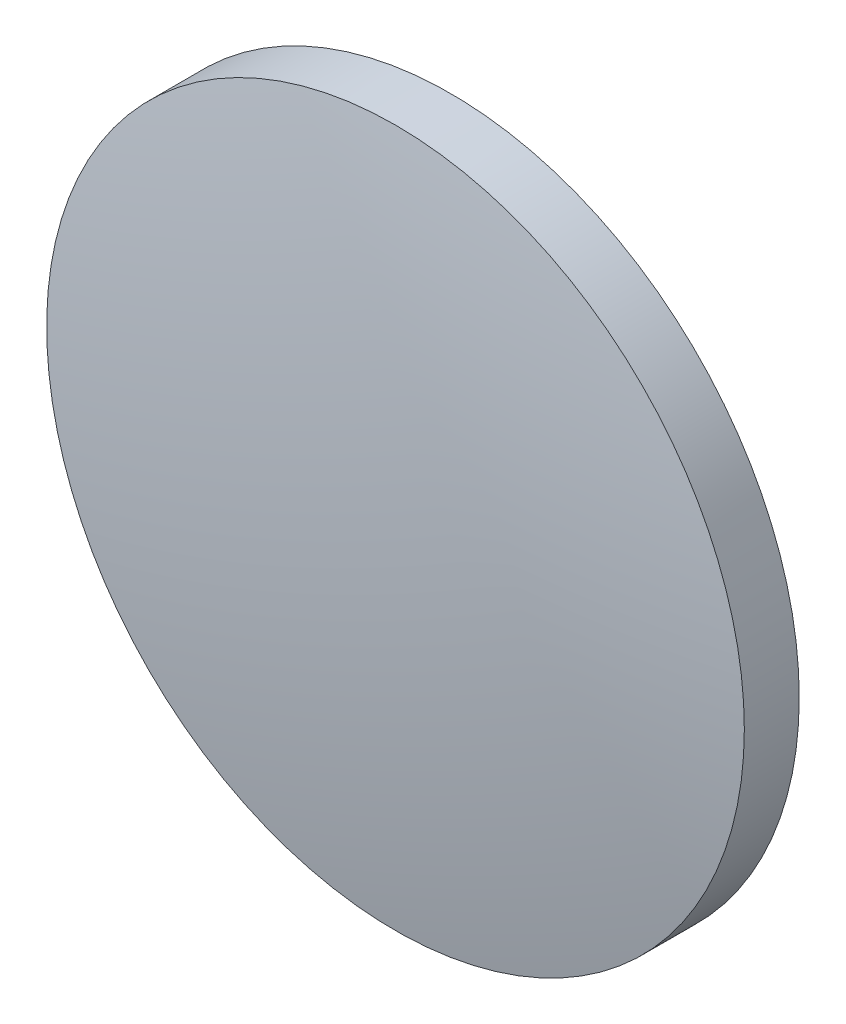
ISO-10303-21;
HEADER;
FILE_DESCRIPTION(('STEP AP214'),'2;1');
FILE_NAME('part.step','',(''),(''),'','','');
FILE_SCHEMA(('AUTOMOTIVE_DESIGN { 1 0 10303 214 1 1 1 1 }'));
ENDSEC;
DATA;
#1=APPLICATION_CONTEXT('core data for automotive mechanical design processes');
#2=APPLICATION_PROTOCOL_DEFINITION('international standard','automotive_design',2000,#1);
#3=PRODUCT_CONTEXT('',#1,'mechanical');
#4=PRODUCT('Part','Part','',(#3));
#5=PRODUCT_RELATED_PRODUCT_CATEGORY('part','',(#4));
#6=PRODUCT_DEFINITION_FORMATION('','',#4);
#7=PRODUCT_DEFINITION_CONTEXT('part definition',#1,'design');
#8=PRODUCT_DEFINITION('design','',#6,#7);
#9=PRODUCT_DEFINITION_SHAPE('','',#8);
#10=(LENGTH_UNIT() NAMED_UNIT(*) SI_UNIT(.MILLI.,.METRE.));
#11=(NAMED_UNIT(*) PLANE_ANGLE_UNIT() SI_UNIT($,.RADIAN.));
#12=(NAMED_UNIT(*) SI_UNIT($,.STERADIAN.) SOLID_ANGLE_UNIT());
#13=UNCERTAINTY_MEASURE_WITH_UNIT(LENGTH_MEASURE(1.E-05),#10,'distance_accuracy_value','');
#14=(GEOMETRIC_REPRESENTATION_CONTEXT(3) GLOBAL_UNCERTAINTY_ASSIGNED_CONTEXT((#13)) GLOBAL_UNIT_ASSIGNED_CONTEXT((#10,
#11,#12)) REPRESENTATION_CONTEXT('',''));
#15=CARTESIAN_POINT('',(0.,0.,0.));
#16=DIRECTION('',(0.,0.,1.));
#17=DIRECTION('',(1.,0.,0.));
#18=AXIS2_PLACEMENT_3D('',#15,#16,#17);
#19=CARTESIAN_POINT('',(0.,0.,-75.735));
#20=DIRECTION('',(0.,0.,1.));
#21=DIRECTION('',(0.,1.,0.));
#22=AXIS2_PLACEMENT_3D('',#19,#20,#21);
#23=SPHERICAL_SURFACE('',#22,77.26);
#24=CARTESIAN_POINT('',(0.,0.,0.474038833986084));
#25=DIRECTION('',(0.,0.,1.));
#26=DIRECTION('',(1.,0.,0.));
#27=AXIS2_PLACEMENT_3D('',#24,#25,#26);
#28=CIRCLE('',#27,12.7);
#29=CARTESIAN_POINT('',(12.7,0.,0.474038833986084));
#30=VERTEX_POINT('',#29);
#31=EDGE_CURVE('E8',#30,#30,#28,.T.);
#32=ORIENTED_EDGE('',*,*,#31,.T.);
#33=EDGE_LOOP('',(#32));
#34=FACE_BOUND('',#33,.T.);
#35=ADVANCED_FACE('F12',(#34),#23,.T.);
#36=CARTESIAN_POINT('',(0.,0.,4.30813204540037));
#37=DIRECTION('',(0.,0.,1.));
#38=DIRECTION('',(1.,0.,0.));
#39=AXIS2_PLACEMENT_3D('',#36,#37,#38);
#40=CYLINDRICAL_SURFACE('',#39,12.7);
#41=ORIENTED_EDGE('',*,*,#31,.F.);
#42=EDGE_LOOP('',(#41));
#43=FACE_BOUND('',#42,.T.);
#44=CARTESIAN_POINT('',(0.,0.,-1.525));
#45=DIRECTION('',(0.,0.,1.));
#46=DIRECTION('',(1.,0.,0.));
#47=AXIS2_PLACEMENT_3D('',#44,#45,#46);
#48=CIRCLE('',#47,12.7);
#49=CARTESIAN_POINT('',(12.7,0.,-1.525));
#50=VERTEX_POINT('',#49);
#51=EDGE_CURVE('E18',#50,#50,#48,.T.);
#52=ORIENTED_EDGE('',*,*,#51,.T.);
#53=EDGE_LOOP('',(#52));
#54=FACE_BOUND('',#53,.T.);
#55=ADVANCED_FACE('F24',(#43,#54),#40,.T.);
#56=CARTESIAN_POINT('',(0.,0.,-1.525));
#57=DIRECTION('',(0.,0.,1.));
#58=DIRECTION('',(1.,0.,0.));
#59=AXIS2_PLACEMENT_3D('',#56,#57,#58);
#60=PLANE('',#59);
#61=ORIENTED_EDGE('',*,*,#51,.F.);
#62=EDGE_LOOP('',(#61));
#63=FACE_BOUND('',#62,.T.);
#64=ADVANCED_FACE('F26',(#63),#60,.F.);
#65=CLOSED_SHELL('',(#35,#55,#64));
#66=MANIFOLD_SOLID_BREP('B1',#65);
#67=ADVANCED_BREP_SHAPE_REPRESENTATION('',(#18,#66),#14);
#68=SHAPE_DEFINITION_REPRESENTATION(#9,#67);
ENDSEC;
END-ISO-10303-21;
